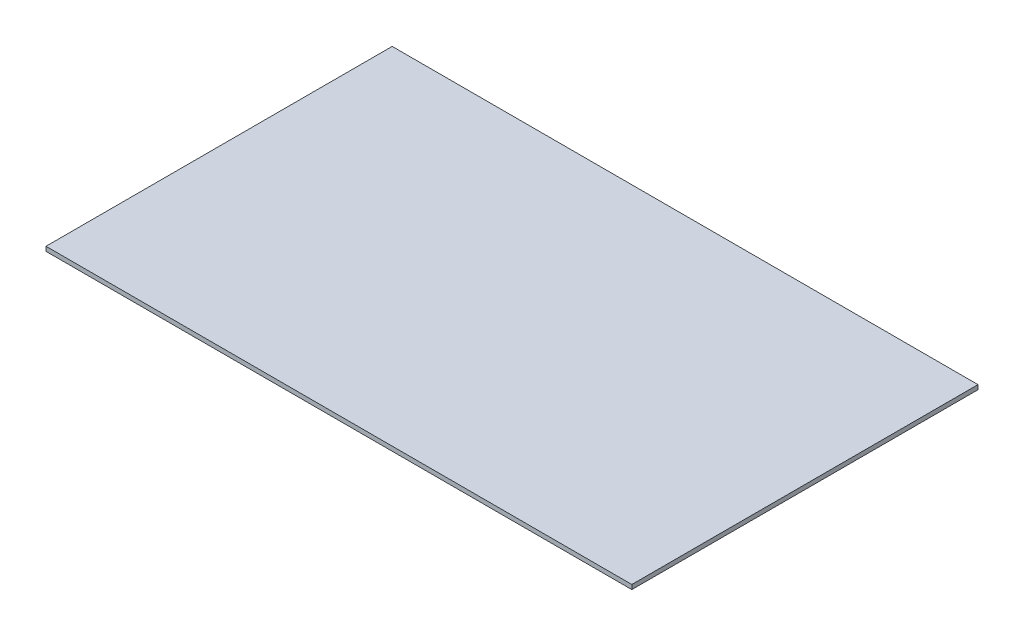
ISO-10303-21;
HEADER;
FILE_DESCRIPTION(('STEP AP214'),'2;1');
FILE_NAME('part.step','',(''),(''),'','','');
FILE_SCHEMA(('AUTOMOTIVE_DESIGN { 1 0 10303 214 1 1 1 1 }'));
ENDSEC;
DATA;
#1=APPLICATION_CONTEXT('core data for automotive mechanical design processes');
#2=APPLICATION_PROTOCOL_DEFINITION('international standard','automotive_design',2000,#1);
#3=PRODUCT_CONTEXT('',#1,'mechanical');
#4=PRODUCT('Part','Part','',(#3));
#5=PRODUCT_RELATED_PRODUCT_CATEGORY('part','',(#4));
#6=PRODUCT_DEFINITION_FORMATION('','',#4);
#7=PRODUCT_DEFINITION_CONTEXT('part definition',#1,'design');
#8=PRODUCT_DEFINITION('design','',#6,#7);
#9=PRODUCT_DEFINITION_SHAPE('','',#8);
#10=(LENGTH_UNIT() NAMED_UNIT(*) SI_UNIT(.MILLI.,.METRE.));
#11=(NAMED_UNIT(*) PLANE_ANGLE_UNIT() SI_UNIT($,.RADIAN.));
#12=(NAMED_UNIT(*) SI_UNIT($,.STERADIAN.) SOLID_ANGLE_UNIT());
#13=UNCERTAINTY_MEASURE_WITH_UNIT(LENGTH_MEASURE(1.E-05),#10,'distance_accuracy_value','');
#14=(GEOMETRIC_REPRESENTATION_CONTEXT(3) GLOBAL_UNCERTAINTY_ASSIGNED_CONTEXT((#13)) GLOBAL_UNIT_ASSIGNED_CONTEXT((#10,
#11,#12)) REPRESENTATION_CONTEXT('',''));
#15=CARTESIAN_POINT('',(0.,0.,0.));
#16=DIRECTION('',(0.,0.,1.));
#17=DIRECTION('',(1.,0.,0.));
#18=AXIS2_PLACEMENT_3D('',#15,#16,#17);
#19=CARTESIAN_POINT('',(0.,25.4,0.));
#20=DIRECTION('',(1.,0.,0.));
#21=DIRECTION('',(0.,0.,-1.));
#22=AXIS2_PLACEMENT_3D('',#19,#20,#21);
#23=PLANE('',#22);
#24=DIRECTION('',(0.,0.,1.));
#25=VECTOR('',#24,1.);
#26=CARTESIAN_POINT('',(0.,0.,0.));
#27=LINE('',#26,#25);
#28=CARTESIAN_POINT('',(0.,0.,0.));
#29=VERTEX_POINT('',#28);
#30=CARTESIAN_POINT('',(2.42627023847074E-13,0.,1981.2));
#31=VERTEX_POINT('',#30);
#32=EDGE_CURVE('E96',#29,#31,#27,.T.);
#33=ORIENTED_EDGE('',*,*,#32,.T.);
#34=DIRECTION('',(0.,-1.,0.));
#35=VECTOR('',#34,1.);
#36=CARTESIAN_POINT('',(2.42627023847074E-13,25.4,1981.2));
#37=LINE('',#36,#35);
#38=CARTESIAN_POINT('',(2.42627023847074E-13,25.4,1981.2));
#39=VERTEX_POINT('',#38);
#40=EDGE_CURVE('E11',#39,#31,#37,.T.);
#41=ORIENTED_EDGE('',*,*,#40,.F.);
#42=DIRECTION('',(0.,0.,1.));
#43=VECTOR('',#42,1.);
#44=CARTESIAN_POINT('',(0.,25.4,0.));
#45=LINE('',#44,#43);
#46=CARTESIAN_POINT('',(0.,25.4,0.));
#47=VERTEX_POINT('',#46);
#48=EDGE_CURVE('E84',#47,#39,#45,.T.);
#49=ORIENTED_EDGE('',*,*,#48,.F.);
#50=DIRECTION('',(0.,-1.,0.));
#51=VECTOR('',#50,1.);
#52=CARTESIAN_POINT('',(0.,25.4,0.));
#53=LINE('',#52,#51);
#54=EDGE_CURVE('E92',#47,#29,#53,.T.);
#55=ORIENTED_EDGE('',*,*,#54,.T.);
#56=EDGE_LOOP('',(#33,#41,#49,#55));
#57=FACE_BOUND('',#56,.T.);
#58=ADVANCED_FACE('F33',(#57),#23,.F.);
#59=CARTESIAN_POINT('',(2.42627023847074E-13,25.4,1981.2));
#60=DIRECTION('',(0.,0.,-1.));
#61=DIRECTION('',(-1.,0.,0.));
#62=AXIS2_PLACEMENT_3D('',#59,#60,#61);
#63=PLANE('',#62);
#64=DIRECTION('',(1.,0.,0.));
#65=VECTOR('',#64,1.);
#66=CARTESIAN_POINT('',(2.42627023847074E-13,0.,1981.2));
#67=LINE('',#66,#65);
#68=CARTESIAN_POINT('',(3352.8,0.,1981.2));
#69=VERTEX_POINT('',#68);
#70=EDGE_CURVE('E88',#31,#69,#67,.T.);
#71=ORIENTED_EDGE('',*,*,#70,.T.);
#72=DIRECTION('',(0.,-1.,0.));
#73=VECTOR('',#72,1.);
#74=CARTESIAN_POINT('',(3352.8,25.4,1981.2));
#75=LINE('',#74,#73);
#76=CARTESIAN_POINT('',(3352.8,25.4,1981.2));
#77=VERTEX_POINT('',#76);
#78=EDGE_CURVE('E41',#77,#69,#75,.T.);
#79=ORIENTED_EDGE('',*,*,#78,.F.);
#80=DIRECTION('',(1.,0.,0.));
#81=VECTOR('',#80,1.);
#82=CARTESIAN_POINT('',(2.42627023847074E-13,25.4,1981.2));
#83=LINE('',#82,#81);
#84=EDGE_CURVE('E79',#39,#77,#83,.T.);
#85=ORIENTED_EDGE('',*,*,#84,.F.);
#86=ORIENTED_EDGE('',*,*,#40,.T.);
#87=EDGE_LOOP('',(#71,#79,#85,#86));
#88=FACE_BOUND('',#87,.T.);
#89=ADVANCED_FACE('F87',(#88),#63,.F.);
#90=CARTESIAN_POINT('',(3352.8,25.4,0.));
#91=DIRECTION('',(-1.,0.,0.));
#92=DIRECTION('',(0.,0.,1.));
#93=AXIS2_PLACEMENT_3D('',#90,#91,#92);
#94=PLANE('',#93);
#95=DIRECTION('',(0.,0.,-1.));
#96=VECTOR('',#95,1.);
#97=CARTESIAN_POINT('',(3352.8,0.,0.));
#98=LINE('',#97,#96);
#99=CARTESIAN_POINT('',(3352.8,0.,0.));
#100=VERTEX_POINT('',#99);
#101=EDGE_CURVE('E66',#69,#100,#98,.T.);
#102=ORIENTED_EDGE('',*,*,#101,.T.);
#103=DIRECTION('',(0.,-1.,0.));
#104=VECTOR('',#103,1.);
#105=CARTESIAN_POINT('',(3352.8,25.4,0.));
#106=LINE('',#105,#104);
#107=CARTESIAN_POINT('',(3352.8,25.4,0.));
#108=VERTEX_POINT('',#107);
#109=EDGE_CURVE('E89',#108,#100,#106,.T.);
#110=ORIENTED_EDGE('',*,*,#109,.F.);
#111=DIRECTION('',(0.,0.,-1.));
#112=VECTOR('',#111,1.);
#113=CARTESIAN_POINT('',(3352.8,25.4,0.));
#114=LINE('',#113,#112);
#115=EDGE_CURVE('E82',#77,#108,#114,.T.);
#116=ORIENTED_EDGE('',*,*,#115,.F.);
#117=ORIENTED_EDGE('',*,*,#78,.T.);
#118=EDGE_LOOP('',(#102,#110,#116,#117));
#119=FACE_BOUND('',#118,.T.);
#120=ADVANCED_FACE('F90',(#119),#94,.F.);
#121=CARTESIAN_POINT('',(0.,25.4,0.));
#122=DIRECTION('',(0.,0.,1.));
#123=DIRECTION('',(1.,0.,0.));
#124=AXIS2_PLACEMENT_3D('',#121,#122,#123);
#125=PLANE('',#124);
#126=DIRECTION('',(-1.,0.,0.));
#127=VECTOR('',#126,1.);
#128=CARTESIAN_POINT('',(0.,0.,0.));
#129=LINE('',#128,#127);
#130=EDGE_CURVE('E72',#100,#29,#129,.T.);
#131=ORIENTED_EDGE('',*,*,#130,.T.);
#132=ORIENTED_EDGE('',*,*,#54,.F.);
#133=DIRECTION('',(-1.,0.,0.));
#134=VECTOR('',#133,1.);
#135=CARTESIAN_POINT('',(0.,25.4,0.));
#136=LINE('',#135,#134);
#137=EDGE_CURVE('E49',#108,#47,#136,.T.);
#138=ORIENTED_EDGE('',*,*,#137,.F.);
#139=ORIENTED_EDGE('',*,*,#109,.T.);
#140=EDGE_LOOP('',(#131,#132,#138,#139));
#141=FACE_BOUND('',#140,.T.);
#142=ADVANCED_FACE('F103',(#141),#125,.F.);
#143=CARTESIAN_POINT('',(0.,25.4,0.));
#144=DIRECTION('',(0.,1.,0.));
#145=DIRECTION('',(0.,0.,1.));
#146=AXIS2_PLACEMENT_3D('',#143,#144,#145);
#147=PLANE('',#146);
#148=ORIENTED_EDGE('',*,*,#48,.T.);
#149=ORIENTED_EDGE('',*,*,#84,.T.);
#150=ORIENTED_EDGE('',*,*,#115,.T.);
#151=ORIENTED_EDGE('',*,*,#137,.T.);
#152=EDGE_LOOP('',(#148,#149,#150,#151));
#153=FACE_BOUND('',#152,.T.);
#154=ADVANCED_FACE('F80',(#153),#147,.T.);
#155=CARTESIAN_POINT('',(0.,0.,0.));
#156=DIRECTION('',(0.,1.,0.));
#157=DIRECTION('',(0.,0.,1.));
#158=AXIS2_PLACEMENT_3D('',#155,#156,#157);
#159=PLANE('',#158);
#160=ORIENTED_EDGE('',*,*,#32,.F.);
#161=ORIENTED_EDGE('',*,*,#130,.F.);
#162=ORIENTED_EDGE('',*,*,#101,.F.);
#163=ORIENTED_EDGE('',*,*,#70,.F.);
#164=EDGE_LOOP('',(#160,#161,#162,#163));
#165=FACE_BOUND('',#164,.T.);
#166=ADVANCED_FACE('F106',(#165),#159,.F.);
#167=CLOSED_SHELL('',(#58,#89,#120,#142,#154,#166));
#168=MANIFOLD_SOLID_BREP('B2',#167);
#169=ADVANCED_BREP_SHAPE_REPRESENTATION('',(#18,#168),#14);
#170=SHAPE_DEFINITION_REPRESENTATION(#9,#169);
ENDSEC;
END-ISO-10303-21;
